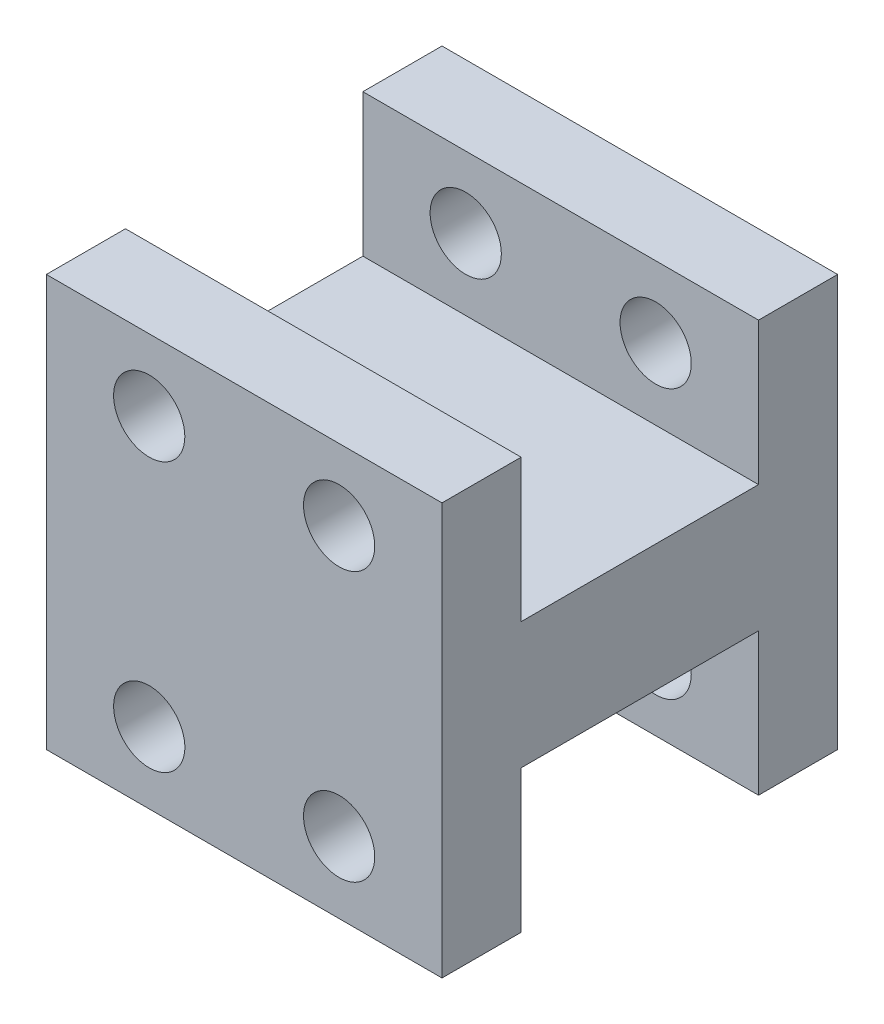
ISO-10303-21;
HEADER;
FILE_DESCRIPTION(('STEP AP214'),'2;1');
FILE_NAME('part.step','',(''),(''),'','','');
FILE_SCHEMA(('AUTOMOTIVE_DESIGN { 1 0 10303 214 1 1 1 1 }'));
ENDSEC;
DATA;
#1=APPLICATION_CONTEXT('core data for automotive mechanical design processes');
#2=APPLICATION_PROTOCOL_DEFINITION('international standard','automotive_design',2000,#1);
#3=PRODUCT_CONTEXT('',#1,'mechanical');
#4=PRODUCT('Part','Part','',(#3));
#5=PRODUCT_RELATED_PRODUCT_CATEGORY('part','',(#4));
#6=PRODUCT_DEFINITION_FORMATION('','',#4);
#7=PRODUCT_DEFINITION_CONTEXT('part definition',#1,'design');
#8=PRODUCT_DEFINITION('design','',#6,#7);
#9=PRODUCT_DEFINITION_SHAPE('','',#8);
#10=(LENGTH_UNIT() NAMED_UNIT(*) SI_UNIT(.MILLI.,.METRE.));
#11=(NAMED_UNIT(*) PLANE_ANGLE_UNIT() SI_UNIT($,.RADIAN.));
#12=(NAMED_UNIT(*) SI_UNIT($,.STERADIAN.) SOLID_ANGLE_UNIT());
#13=UNCERTAINTY_MEASURE_WITH_UNIT(LENGTH_MEASURE(1.E-05),#10,'distance_accuracy_value','');
#14=(GEOMETRIC_REPRESENTATION_CONTEXT(3) GLOBAL_UNCERTAINTY_ASSIGNED_CONTEXT((#13)) GLOBAL_UNIT_ASSIGNED_CONTEXT((#10,
#11,#12)) REPRESENTATION_CONTEXT('',''));
#15=CARTESIAN_POINT('',(0.,0.,0.));
#16=DIRECTION('',(0.,0.,1.));
#17=DIRECTION('',(1.,0.,0.));
#18=AXIS2_PLACEMENT_3D('',#15,#16,#17);
#19=CARTESIAN_POINT('',(0.,0.,5.));
#20=DIRECTION('',(1.,0.,0.));
#21=DIRECTION('',(0.,1.,0.));
#22=AXIS2_PLACEMENT_3D('',#19,#20,#21);
#23=PLANE('',#22);
#24=DIRECTION('',(0.,0.,-1.));
#25=VECTOR('',#24,1.);
#26=CARTESIAN_POINT('',(0.,29.,20.));
#27=LINE('',#26,#25);
#28=CARTESIAN_POINT('',(0.,29.,20.));
#29=VERTEX_POINT('',#28);
#30=CARTESIAN_POINT('',(0.,29.,5.));
#31=VERTEX_POINT('',#30);
#32=EDGE_CURVE('E42',#29,#31,#27,.T.);
#33=ORIENTED_EDGE('',*,*,#32,.T.);
#34=DIRECTION('',(0.,-1.,0.));
#35=VECTOR('',#34,1.);
#36=CARTESIAN_POINT('',(0.,12.,5.));
#37=LINE('',#36,#35);
#38=CARTESIAN_POINT('',(0.,38.,5.));
#39=VERTEX_POINT('',#38);
#40=EDGE_CURVE('E163',#39,#31,#37,.T.);
#41=ORIENTED_EDGE('',*,*,#40,.F.);
#42=DIRECTION('',(0.,0.,1.));
#43=VECTOR('',#42,1.);
#44=CARTESIAN_POINT('',(0.,38.,0.));
#45=LINE('',#44,#43);
#46=CARTESIAN_POINT('',(0.,38.,0.));
#47=VERTEX_POINT('',#46);
#48=EDGE_CURVE('E168',#47,#39,#45,.T.);
#49=ORIENTED_EDGE('',*,*,#48,.F.);
#50=DIRECTION('',(0.,-1.,0.));
#51=VECTOR('',#50,1.);
#52=CARTESIAN_POINT('',(0.,12.,0.));
#53=LINE('',#52,#51);
#54=CARTESIAN_POINT('',(0.,12.,0.));
#55=VERTEX_POINT('',#54);
#56=EDGE_CURVE('E151',#47,#55,#53,.T.);
#57=ORIENTED_EDGE('',*,*,#56,.T.);
#58=DIRECTION('',(0.,0.,1.));
#59=VECTOR('',#58,1.);
#60=CARTESIAN_POINT('',(0.,12.,0.));
#61=LINE('',#60,#59);
#62=CARTESIAN_POINT('',(0.,12.,5.));
#63=VERTEX_POINT('',#62);
#64=EDGE_CURVE('E137',#55,#63,#61,.T.);
#65=ORIENTED_EDGE('',*,*,#64,.T.);
#66=CARTESIAN_POINT('',(0.,21.,5.));
#67=VERTEX_POINT('',#66);
#68=EDGE_CURVE('E162',#67,#63,#37,.T.);
#69=ORIENTED_EDGE('',*,*,#68,.F.);
#70=DIRECTION('',(0.,0.,-1.));
#71=VECTOR('',#70,1.);
#72=CARTESIAN_POINT('',(0.,21.,20.));
#73=LINE('',#72,#71);
#74=CARTESIAN_POINT('',(0.,21.,20.));
#75=VERTEX_POINT('',#74);
#76=EDGE_CURVE('E49',#75,#67,#73,.T.);
#77=ORIENTED_EDGE('',*,*,#76,.F.);
#78=DIRECTION('',(0.,-1.,0.));
#79=VECTOR('',#78,1.);
#80=CARTESIAN_POINT('',(0.,12.,20.));
#81=LINE('',#80,#79);
#82=CARTESIAN_POINT('',(0.,12.,20.));
#83=VERTEX_POINT('',#82);
#84=EDGE_CURVE('E211',#75,#83,#81,.T.);
#85=ORIENTED_EDGE('',*,*,#84,.T.);
#86=DIRECTION('',(0.,0.,-1.));
#87=VECTOR('',#86,1.);
#88=CARTESIAN_POINT('',(0.,12.,25.));
#89=LINE('',#88,#87);
#90=CARTESIAN_POINT('',(0.,12.,25.));
#91=VERTEX_POINT('',#90);
#92=EDGE_CURVE('E218',#91,#83,#89,.T.);
#93=ORIENTED_EDGE('',*,*,#92,.F.);
#94=DIRECTION('',(0.,-1.,0.));
#95=VECTOR('',#94,1.);
#96=CARTESIAN_POINT('',(0.,12.,25.));
#97=LINE('',#96,#95);
#98=CARTESIAN_POINT('',(0.,38.,25.));
#99=VERTEX_POINT('',#98);
#100=EDGE_CURVE('E201',#99,#91,#97,.T.);
#101=ORIENTED_EDGE('',*,*,#100,.F.);
#102=DIRECTION('',(0.,0.,-1.));
#103=VECTOR('',#102,1.);
#104=CARTESIAN_POINT('',(0.,38.,25.));
#105=LINE('',#104,#103);
#106=CARTESIAN_POINT('',(0.,38.,20.));
#107=VERTEX_POINT('',#106);
#108=EDGE_CURVE('E221',#99,#107,#105,.T.);
#109=ORIENTED_EDGE('',*,*,#108,.T.);
#110=EDGE_CURVE('E212',#107,#29,#81,.T.);
#111=ORIENTED_EDGE('',*,*,#110,.T.);
#112=EDGE_LOOP('',(#33,#41,#49,#57,#65,#69,#77,#85,#93,#101,#109,#111));
#113=FACE_BOUND('',#112,.T.);
#114=ADVANCED_FACE('F35',(#113),#23,.F.);
#115=CARTESIAN_POINT('',(25.,0.,5.));
#116=DIRECTION('',(-1.,0.,0.));
#117=DIRECTION('',(0.,-1.,0.));
#118=AXIS2_PLACEMENT_3D('',#115,#116,#117);
#119=PLANE('',#118);
#120=DIRECTION('',(0.,0.,-1.));
#121=VECTOR('',#120,1.);
#122=CARTESIAN_POINT('',(25.,21.,20.));
#123=LINE('',#122,#121);
#124=CARTESIAN_POINT('',(25.,21.,20.));
#125=VERTEX_POINT('',#124);
#126=CARTESIAN_POINT('',(25.,21.,5.));
#127=VERTEX_POINT('',#126);
#128=EDGE_CURVE('E234',#125,#127,#123,.T.);
#129=ORIENTED_EDGE('',*,*,#128,.T.);
#130=DIRECTION('',(0.,1.,0.));
#131=VECTOR('',#130,1.);
#132=CARTESIAN_POINT('',(25.,12.,5.));
#133=LINE('',#132,#131);
#134=CARTESIAN_POINT('',(25.,12.,5.));
#135=VERTEX_POINT('',#134);
#136=EDGE_CURVE('E131',#135,#127,#133,.T.);
#137=ORIENTED_EDGE('',*,*,#136,.F.);
#138=DIRECTION('',(0.,0.,1.));
#139=VECTOR('',#138,1.);
#140=CARTESIAN_POINT('',(25.,12.,0.));
#141=LINE('',#140,#139);
#142=CARTESIAN_POINT('',(25.,12.,0.));
#143=VERTEX_POINT('',#142);
#144=EDGE_CURVE('E124',#143,#135,#141,.T.);
#145=ORIENTED_EDGE('',*,*,#144,.F.);
#146=DIRECTION('',(0.,1.,0.));
#147=VECTOR('',#146,1.);
#148=CARTESIAN_POINT('',(25.,12.,0.));
#149=LINE('',#148,#147);
#150=CARTESIAN_POINT('',(25.,38.,0.));
#151=VERTEX_POINT('',#150);
#152=EDGE_CURVE('E129',#143,#151,#149,.T.);
#153=ORIENTED_EDGE('',*,*,#152,.T.);
#154=DIRECTION('',(0.,0.,1.));
#155=VECTOR('',#154,1.);
#156=CARTESIAN_POINT('',(25.,38.,0.));
#157=LINE('',#156,#155);
#158=CARTESIAN_POINT('',(25.,38.,5.));
#159=VERTEX_POINT('',#158);
#160=EDGE_CURVE('E157',#151,#159,#157,.T.);
#161=ORIENTED_EDGE('',*,*,#160,.T.);
#162=CARTESIAN_POINT('',(25.,29.,5.));
#163=VERTEX_POINT('',#162);
#164=EDGE_CURVE('E160',#163,#159,#133,.T.);
#165=ORIENTED_EDGE('',*,*,#164,.F.);
#166=DIRECTION('',(0.,0.,-1.));
#167=VECTOR('',#166,1.);
#168=CARTESIAN_POINT('',(25.,29.,20.));
#169=LINE('',#168,#167);
#170=CARTESIAN_POINT('',(25.,29.,20.));
#171=VERTEX_POINT('',#170);
#172=EDGE_CURVE('E11',#171,#163,#169,.T.);
#173=ORIENTED_EDGE('',*,*,#172,.F.);
#174=DIRECTION('',(0.,1.,0.));
#175=VECTOR('',#174,1.);
#176=CARTESIAN_POINT('',(25.,12.,20.));
#177=LINE('',#176,#175);
#178=CARTESIAN_POINT('',(25.,38.,20.));
#179=VERTEX_POINT('',#178);
#180=EDGE_CURVE('E192',#171,#179,#177,.T.);
#181=ORIENTED_EDGE('',*,*,#180,.T.);
#182=DIRECTION('',(0.,0.,-1.));
#183=VECTOR('',#182,1.);
#184=CARTESIAN_POINT('',(25.,38.,25.));
#185=LINE('',#184,#183);
#186=CARTESIAN_POINT('',(25.,38.,25.));
#187=VERTEX_POINT('',#186);
#188=EDGE_CURVE('E224',#187,#179,#185,.T.);
#189=ORIENTED_EDGE('',*,*,#188,.F.);
#190=DIRECTION('',(0.,1.,0.));
#191=VECTOR('',#190,1.);
#192=CARTESIAN_POINT('',(25.,12.,25.));
#193=LINE('',#192,#191);
#194=CARTESIAN_POINT('',(25.,12.,25.));
#195=VERTEX_POINT('',#194);
#196=EDGE_CURVE('E195',#195,#187,#193,.T.);
#197=ORIENTED_EDGE('',*,*,#196,.F.);
#198=DIRECTION('',(0.,0.,-1.));
#199=VECTOR('',#198,1.);
#200=CARTESIAN_POINT('',(25.,12.,25.));
#201=LINE('',#200,#199);
#202=CARTESIAN_POINT('',(25.,12.,20.));
#203=VERTEX_POINT('',#202);
#204=EDGE_CURVE('E205',#195,#203,#201,.T.);
#205=ORIENTED_EDGE('',*,*,#204,.T.);
#206=EDGE_CURVE('E206',#203,#125,#177,.T.);
#207=ORIENTED_EDGE('',*,*,#206,.T.);
#208=EDGE_LOOP('',(#129,#137,#145,#153,#161,#165,#173,#181,#189,#197,#205,#207));
#209=FACE_BOUND('',#208,.T.);
#210=ADVANCED_FACE('F127',(#209),#119,.F.);
#211=CARTESIAN_POINT('',(25.,29.,20.));
#212=DIRECTION('',(0.,-1.,0.));
#213=DIRECTION('',(1.,0.,0.));
#214=AXIS2_PLACEMENT_3D('',#211,#212,#213);
#215=PLANE('',#214);
#216=DIRECTION('',(-1.,0.,0.));
#217=VECTOR('',#216,1.);
#218=CARTESIAN_POINT('',(25.,29.,5.));
#219=LINE('',#218,#217);
#220=EDGE_CURVE('E227',#163,#31,#219,.T.);
#221=ORIENTED_EDGE('',*,*,#220,.T.);
#222=ORIENTED_EDGE('',*,*,#32,.F.);
#223=DIRECTION('',(-1.,0.,0.));
#224=VECTOR('',#223,1.);
#225=CARTESIAN_POINT('',(25.,29.,20.));
#226=LINE('',#225,#224);
#227=EDGE_CURVE('E228',#171,#29,#226,.T.);
#228=ORIENTED_EDGE('',*,*,#227,.F.);
#229=ORIENTED_EDGE('',*,*,#172,.T.);
#230=EDGE_LOOP('',(#221,#222,#228,#229));
#231=FACE_BOUND('',#230,.T.);
#232=ADVANCED_FACE('F248',(#231),#215,.F.);
#233=CARTESIAN_POINT('',(25.,21.,20.));
#234=DIRECTION('',(0.,1.,0.));
#235=DIRECTION('',(-1.,0.,0.));
#236=AXIS2_PLACEMENT_3D('',#233,#234,#235);
#237=PLANE('',#236);
#238=DIRECTION('',(1.,0.,0.));
#239=VECTOR('',#238,1.);
#240=CARTESIAN_POINT('',(25.,21.,5.));
#241=LINE('',#240,#239);
#242=EDGE_CURVE('E231',#67,#127,#241,.T.);
#243=ORIENTED_EDGE('',*,*,#242,.T.);
#244=ORIENTED_EDGE('',*,*,#128,.F.);
#245=DIRECTION('',(1.,0.,0.));
#246=VECTOR('',#245,1.);
#247=CARTESIAN_POINT('',(25.,21.,20.));
#248=LINE('',#247,#246);
#249=EDGE_CURVE('E230',#75,#125,#248,.T.);
#250=ORIENTED_EDGE('',*,*,#249,.F.);
#251=ORIENTED_EDGE('',*,*,#76,.T.);
#252=EDGE_LOOP('',(#243,#244,#250,#251));
#253=FACE_BOUND('',#252,.T.);
#254=ADVANCED_FACE('F307',(#253),#237,.F.);
#255=CARTESIAN_POINT('',(0.,0.,20.));
#256=DIRECTION('',(0.,0.,1.));
#257=DIRECTION('',(1.,0.,0.));
#258=AXIS2_PLACEMENT_3D('',#255,#256,#257);
#259=PLANE('',#258);
#260=CARTESIAN_POINT('',(6.5,33.5,20.));
#261=DIRECTION('',(0.,0.,-1.));
#262=DIRECTION('',(1.,0.,0.));
#263=AXIS2_PLACEMENT_3D('',#260,#261,#262);
#264=CIRCLE('',#263,2.25);
#265=CARTESIAN_POINT('',(8.75,33.5,20.));
#266=VERTEX_POINT('',#265);
#267=EDGE_CURVE('E175',#266,#266,#264,.T.);
#268=ORIENTED_EDGE('',*,*,#267,.F.);
#269=EDGE_LOOP('',(#268));
#270=FACE_BOUND('',#269,.T.);
#271=CARTESIAN_POINT('',(18.5,33.5,20.));
#272=DIRECTION('',(0.,0.,-1.));
#273=DIRECTION('',(-1.,0.,0.));
#274=AXIS2_PLACEMENT_3D('',#271,#272,#273);
#275=CIRCLE('',#274,2.25);
#276=CARTESIAN_POINT('',(16.25,33.5,20.));
#277=VERTEX_POINT('',#276);
#278=EDGE_CURVE('E174',#277,#277,#275,.T.);
#279=ORIENTED_EDGE('',*,*,#278,.F.);
#280=EDGE_LOOP('',(#279));
#281=FACE_BOUND('',#280,.T.);
#282=ORIENTED_EDGE('',*,*,#180,.F.);
#283=ORIENTED_EDGE('',*,*,#227,.T.);
#284=ORIENTED_EDGE('',*,*,#110,.F.);
#285=DIRECTION('',(-1.,0.,0.));
#286=VECTOR('',#285,1.);
#287=CARTESIAN_POINT('',(25.,38.,20.));
#288=LINE('',#287,#286);
#289=EDGE_CURVE('E209',#179,#107,#288,.T.);
#290=ORIENTED_EDGE('',*,*,#289,.F.);
#291=EDGE_LOOP('',(#282,#283,#284,#290));
#292=FACE_BOUND('',#291,.T.);
#293=ADVANCED_FACE('F246',(#270,#281,#292),#259,.F.);
#294=CARTESIAN_POINT('',(6.5,16.5,20.));
#295=DIRECTION('',(0.,0.,-1.));
#296=DIRECTION('',(-1.,0.,0.));
#297=AXIS2_PLACEMENT_3D('',#294,#295,#296);
#298=CIRCLE('',#297,2.25);
#299=CARTESIAN_POINT('',(4.25,16.5,20.));
#300=VERTEX_POINT('',#299);
#301=EDGE_CURVE('E181',#300,#300,#298,.T.);
#302=ORIENTED_EDGE('',*,*,#301,.F.);
#303=EDGE_LOOP('',(#302));
#304=FACE_BOUND('',#303,.T.);
#305=CARTESIAN_POINT('',(18.5,16.5,20.));
#306=DIRECTION('',(0.,0.,-1.));
#307=DIRECTION('',(1.,0.,0.));
#308=AXIS2_PLACEMENT_3D('',#305,#306,#307);
#309=CIRCLE('',#308,2.25);
#310=CARTESIAN_POINT('',(20.75,16.5,20.));
#311=VERTEX_POINT('',#310);
#312=EDGE_CURVE('E136',#311,#311,#309,.T.);
#313=ORIENTED_EDGE('',*,*,#312,.F.);
#314=EDGE_LOOP('',(#313));
#315=FACE_BOUND('',#314,.T.);
#316=ORIENTED_EDGE('',*,*,#84,.F.);
#317=ORIENTED_EDGE('',*,*,#249,.T.);
#318=ORIENTED_EDGE('',*,*,#206,.F.);
#319=DIRECTION('',(1.,0.,0.));
#320=VECTOR('',#319,1.);
#321=CARTESIAN_POINT('',(25.,12.,20.));
#322=LINE('',#321,#320);
#323=EDGE_CURVE('E199',#83,#203,#322,.T.);
#324=ORIENTED_EDGE('',*,*,#323,.F.);
#325=EDGE_LOOP('',(#316,#317,#318,#324));
#326=FACE_BOUND('',#325,.T.);
#327=ADVANCED_FACE('F312',(#304,#315,#326),#259,.F.);
#328=CARTESIAN_POINT('',(25.,38.,25.));
#329=DIRECTION('',(0.,-1.,0.));
#330=DIRECTION('',(1.,0.,0.));
#331=AXIS2_PLACEMENT_3D('',#328,#329,#330);
#332=PLANE('',#331);
#333=ORIENTED_EDGE('',*,*,#289,.T.);
#334=ORIENTED_EDGE('',*,*,#108,.F.);
#335=DIRECTION('',(-1.,0.,0.));
#336=VECTOR('',#335,1.);
#337=CARTESIAN_POINT('',(25.,38.,25.));
#338=LINE('',#337,#336);
#339=EDGE_CURVE('E198',#187,#99,#338,.T.);
#340=ORIENTED_EDGE('',*,*,#339,.F.);
#341=ORIENTED_EDGE('',*,*,#188,.T.);
#342=EDGE_LOOP('',(#333,#334,#340,#341));
#343=FACE_BOUND('',#342,.T.);
#344=ADVANCED_FACE('F322',(#343),#332,.F.);
#345=CARTESIAN_POINT('',(25.,12.,25.));
#346=DIRECTION('',(0.,1.,0.));
#347=DIRECTION('',(-1.,0.,0.));
#348=AXIS2_PLACEMENT_3D('',#345,#346,#347);
#349=PLANE('',#348);
#350=ORIENTED_EDGE('',*,*,#323,.T.);
#351=ORIENTED_EDGE('',*,*,#204,.F.);
#352=DIRECTION('',(1.,0.,0.));
#353=VECTOR('',#352,1.);
#354=CARTESIAN_POINT('',(25.,12.,25.));
#355=LINE('',#354,#353);
#356=EDGE_CURVE('E203',#91,#195,#355,.T.);
#357=ORIENTED_EDGE('',*,*,#356,.F.);
#358=ORIENTED_EDGE('',*,*,#92,.T.);
#359=EDGE_LOOP('',(#350,#351,#357,#358));
#360=FACE_BOUND('',#359,.T.);
#361=ADVANCED_FACE('F316',(#360),#349,.F.);
#362=CARTESIAN_POINT('',(0.,0.,25.));
#363=DIRECTION('',(0.,0.,1.));
#364=DIRECTION('',(1.,0.,0.));
#365=AXIS2_PLACEMENT_3D('',#362,#363,#364);
#366=PLANE('',#365);
#367=CARTESIAN_POINT('',(6.5,33.5,25.));
#368=DIRECTION('',(0.,0.,-1.));
#369=DIRECTION('',(1.,0.,0.));
#370=AXIS2_PLACEMENT_3D('',#367,#368,#369);
#371=CIRCLE('',#370,2.25);
#372=CARTESIAN_POINT('',(8.75,33.5,25.));
#373=VERTEX_POINT('',#372);
#374=EDGE_CURVE('E171',#373,#373,#371,.T.);
#375=ORIENTED_EDGE('',*,*,#374,.T.);
#376=EDGE_LOOP('',(#375));
#377=FACE_BOUND('',#376,.T.);
#378=CARTESIAN_POINT('',(6.5,16.5,25.));
#379=DIRECTION('',(0.,0.,-1.));
#380=DIRECTION('',(-1.,0.,0.));
#381=AXIS2_PLACEMENT_3D('',#378,#379,#380);
#382=CIRCLE('',#381,2.25);
#383=CARTESIAN_POINT('',(4.25,16.5,25.));
#384=VERTEX_POINT('',#383);
#385=EDGE_CURVE('E178',#384,#384,#382,.T.);
#386=ORIENTED_EDGE('',*,*,#385,.T.);
#387=EDGE_LOOP('',(#386));
#388=FACE_BOUND('',#387,.T.);
#389=CARTESIAN_POINT('',(18.5,16.5,25.));
#390=DIRECTION('',(0.,0.,-1.));
#391=DIRECTION('',(1.,0.,0.));
#392=AXIS2_PLACEMENT_3D('',#389,#390,#391);
#393=CIRCLE('',#392,2.25);
#394=CARTESIAN_POINT('',(20.75,16.5,25.));
#395=VERTEX_POINT('',#394);
#396=EDGE_CURVE('E184',#395,#395,#393,.T.);
#397=ORIENTED_EDGE('',*,*,#396,.T.);
#398=EDGE_LOOP('',(#397));
#399=FACE_BOUND('',#398,.T.);
#400=CARTESIAN_POINT('',(18.5,33.5,25.));
#401=DIRECTION('',(0.,0.,-1.));
#402=DIRECTION('',(-1.,0.,0.));
#403=AXIS2_PLACEMENT_3D('',#400,#401,#402);
#404=CIRCLE('',#403,2.25);
#405=CARTESIAN_POINT('',(16.25,33.5,25.));
#406=VERTEX_POINT('',#405);
#407=EDGE_CURVE('E189',#406,#406,#404,.T.);
#408=ORIENTED_EDGE('',*,*,#407,.T.);
#409=EDGE_LOOP('',(#408));
#410=FACE_BOUND('',#409,.T.);
#411=ORIENTED_EDGE('',*,*,#196,.T.);
#412=ORIENTED_EDGE('',*,*,#339,.T.);
#413=ORIENTED_EDGE('',*,*,#100,.T.);
#414=ORIENTED_EDGE('',*,*,#356,.T.);
#415=EDGE_LOOP('',(#411,#412,#413,#414));
#416=FACE_BOUND('',#415,.T.);
#417=ADVANCED_FACE('F320',(#377,#388,#399,#410,#416),#366,.T.);
#418=CARTESIAN_POINT('',(18.5,33.5,25.));
#419=DIRECTION('',(0.,0.,-1.));
#420=DIRECTION('',(-1.,0.,0.));
#421=AXIS2_PLACEMENT_3D('',#418,#419,#420);
#422=CYLINDRICAL_SURFACE('',#421,2.25);
#423=ORIENTED_EDGE('',*,*,#407,.F.);
#424=EDGE_LOOP('',(#423));
#425=FACE_BOUND('',#424,.T.);
#426=ORIENTED_EDGE('',*,*,#278,.T.);
#427=EDGE_LOOP('',(#426));
#428=FACE_BOUND('',#427,.T.);
#429=ADVANCED_FACE('F353',(#425,#428),#422,.F.);
#430=CARTESIAN_POINT('',(18.5,16.5,25.));
#431=DIRECTION('',(0.,0.,-1.));
#432=DIRECTION('',(-1.,0.,0.));
#433=AXIS2_PLACEMENT_3D('',#430,#431,#432);
#434=CYLINDRICAL_SURFACE('',#433,2.25);
#435=ORIENTED_EDGE('',*,*,#396,.F.);
#436=EDGE_LOOP('',(#435));
#437=FACE_BOUND('',#436,.T.);
#438=ORIENTED_EDGE('',*,*,#312,.T.);
#439=EDGE_LOOP('',(#438));
#440=FACE_BOUND('',#439,.T.);
#441=ADVANCED_FACE('F357',(#437,#440),#434,.F.);
#442=CARTESIAN_POINT('',(6.5,16.5,25.));
#443=DIRECTION('',(0.,0.,-1.));
#444=DIRECTION('',(-1.,0.,0.));
#445=AXIS2_PLACEMENT_3D('',#442,#443,#444);
#446=CYLINDRICAL_SURFACE('',#445,2.25);
#447=ORIENTED_EDGE('',*,*,#385,.F.);
#448=EDGE_LOOP('',(#447));
#449=FACE_BOUND('',#448,.T.);
#450=ORIENTED_EDGE('',*,*,#301,.T.);
#451=EDGE_LOOP('',(#450));
#452=FACE_BOUND('',#451,.T.);
#453=ADVANCED_FACE('F361',(#449,#452),#446,.F.);
#454=CARTESIAN_POINT('',(6.5,33.5,25.));
#455=DIRECTION('',(0.,0.,-1.));
#456=DIRECTION('',(-1.,0.,0.));
#457=AXIS2_PLACEMENT_3D('',#454,#455,#456);
#458=CYLINDRICAL_SURFACE('',#457,2.25);
#459=ORIENTED_EDGE('',*,*,#374,.F.);
#460=EDGE_LOOP('',(#459));
#461=FACE_BOUND('',#460,.T.);
#462=ORIENTED_EDGE('',*,*,#267,.T.);
#463=EDGE_LOOP('',(#462));
#464=FACE_BOUND('',#463,.T.);
#465=ADVANCED_FACE('F303',(#461,#464),#458,.F.);
#466=CARTESIAN_POINT('',(0.,0.,5.));
#467=DIRECTION('',(0.,0.,-1.));
#468=DIRECTION('',(1.,0.,0.));
#469=AXIS2_PLACEMENT_3D('',#466,#467,#468);
#470=PLANE('',#469);
#471=CARTESIAN_POINT('',(6.5,16.5,5.));
#472=DIRECTION('',(0.,0.,-1.));
#473=DIRECTION('',(-1.,0.,0.));
#474=AXIS2_PLACEMENT_3D('',#471,#472,#473);
#475=CIRCLE('',#474,2.25);
#476=CARTESIAN_POINT('',(4.25,16.5,5.));
#477=VERTEX_POINT('',#476);
#478=EDGE_CURVE('E268',#477,#477,#475,.T.);
#479=ORIENTED_EDGE('',*,*,#478,.T.);
#480=EDGE_LOOP('',(#479));
#481=FACE_BOUND('',#480,.T.);
#482=CARTESIAN_POINT('',(18.5,16.5,5.));
#483=DIRECTION('',(0.,0.,-1.));
#484=DIRECTION('',(1.,0.,0.));
#485=AXIS2_PLACEMENT_3D('',#482,#483,#484);
#486=CIRCLE('',#485,2.25);
#487=CARTESIAN_POINT('',(20.75,16.5,5.));
#488=VERTEX_POINT('',#487);
#489=EDGE_CURVE('E262',#488,#488,#486,.T.);
#490=ORIENTED_EDGE('',*,*,#489,.T.);
#491=EDGE_LOOP('',(#490));
#492=FACE_BOUND('',#491,.T.);
#493=ORIENTED_EDGE('',*,*,#242,.F.);
#494=ORIENTED_EDGE('',*,*,#68,.T.);
#495=DIRECTION('',(1.,0.,0.));
#496=VECTOR('',#495,1.);
#497=CARTESIAN_POINT('',(25.,12.,5.));
#498=LINE('',#497,#496);
#499=EDGE_CURVE('E159',#63,#135,#498,.T.);
#500=ORIENTED_EDGE('',*,*,#499,.T.);
#501=ORIENTED_EDGE('',*,*,#136,.T.);
#502=EDGE_LOOP('',(#493,#494,#500,#501));
#503=FACE_BOUND('',#502,.T.);
#504=ADVANCED_FACE('F300',(#481,#492,#503),#470,.F.);
#505=CARTESIAN_POINT('',(25.,12.,0.));
#506=DIRECTION('',(0.,-1.,0.));
#507=DIRECTION('',(1.,0.,0.));
#508=AXIS2_PLACEMENT_3D('',#505,#506,#507);
#509=PLANE('',#508);
#510=ORIENTED_EDGE('',*,*,#499,.F.);
#511=ORIENTED_EDGE('',*,*,#64,.F.);
#512=DIRECTION('',(1.,0.,0.));
#513=VECTOR('',#512,1.);
#514=CARTESIAN_POINT('',(25.,12.,0.));
#515=LINE('',#514,#513);
#516=EDGE_CURVE('E143',#55,#143,#515,.T.);
#517=ORIENTED_EDGE('',*,*,#516,.T.);
#518=ORIENTED_EDGE('',*,*,#144,.T.);
#519=EDGE_LOOP('',(#510,#511,#517,#518));
#520=FACE_BOUND('',#519,.T.);
#521=ADVANCED_FACE('F149',(#520),#509,.T.);
#522=CARTESIAN_POINT('',(25.,38.,0.));
#523=DIRECTION('',(0.,1.,0.));
#524=DIRECTION('',(-1.,0.,0.));
#525=AXIS2_PLACEMENT_3D('',#522,#523,#524);
#526=PLANE('',#525);
#527=DIRECTION('',(-1.,0.,0.));
#528=VECTOR('',#527,1.);
#529=CARTESIAN_POINT('',(25.,38.,5.));
#530=LINE('',#529,#528);
#531=EDGE_CURVE('E147',#159,#39,#530,.T.);
#532=ORIENTED_EDGE('',*,*,#531,.F.);
#533=ORIENTED_EDGE('',*,*,#160,.F.);
#534=DIRECTION('',(-1.,0.,0.));
#535=VECTOR('',#534,1.);
#536=CARTESIAN_POINT('',(25.,38.,0.));
#537=LINE('',#536,#535);
#538=EDGE_CURVE('E146',#151,#47,#537,.T.);
#539=ORIENTED_EDGE('',*,*,#538,.T.);
#540=ORIENTED_EDGE('',*,*,#48,.T.);
#541=EDGE_LOOP('',(#532,#533,#539,#540));
#542=FACE_BOUND('',#541,.T.);
#543=ADVANCED_FACE('F286',(#542),#526,.T.);
#544=CARTESIAN_POINT('',(0.,0.,0.));
#545=DIRECTION('',(0.,0.,-1.));
#546=DIRECTION('',(1.,0.,0.));
#547=AXIS2_PLACEMENT_3D('',#544,#545,#546);
#548=PLANE('',#547);
#549=CARTESIAN_POINT('',(6.5,33.5,0.));
#550=DIRECTION('',(0.,0.,-1.));
#551=DIRECTION('',(1.,0.,0.));
#552=AXIS2_PLACEMENT_3D('',#549,#550,#551);
#553=CIRCLE('',#552,2.25);
#554=CARTESIAN_POINT('',(8.75,33.5,0.));
#555=VERTEX_POINT('',#554);
#556=EDGE_CURVE('E260',#555,#555,#553,.T.);
#557=ORIENTED_EDGE('',*,*,#556,.F.);
#558=EDGE_LOOP('',(#557));
#559=FACE_BOUND('',#558,.T.);
#560=CARTESIAN_POINT('',(6.5,16.5,0.));
#561=DIRECTION('',(0.,0.,-1.));
#562=DIRECTION('',(-1.,0.,0.));
#563=AXIS2_PLACEMENT_3D('',#560,#561,#562);
#564=CIRCLE('',#563,2.25);
#565=CARTESIAN_POINT('',(4.25,16.5,0.));
#566=VERTEX_POINT('',#565);
#567=EDGE_CURVE('E271',#566,#566,#564,.T.);
#568=ORIENTED_EDGE('',*,*,#567,.F.);
#569=EDGE_LOOP('',(#568));
#570=FACE_BOUND('',#569,.T.);
#571=CARTESIAN_POINT('',(18.5,16.5,0.));
#572=DIRECTION('',(0.,0.,-1.));
#573=DIRECTION('',(1.,0.,0.));
#574=AXIS2_PLACEMENT_3D('',#571,#572,#573);
#575=CIRCLE('',#574,2.25);
#576=CARTESIAN_POINT('',(20.75,16.5,0.));
#577=VERTEX_POINT('',#576);
#578=EDGE_CURVE('E265',#577,#577,#575,.T.);
#579=ORIENTED_EDGE('',*,*,#578,.F.);
#580=EDGE_LOOP('',(#579));
#581=FACE_BOUND('',#580,.T.);
#582=CARTESIAN_POINT('',(18.5,33.5,0.));
#583=DIRECTION('',(0.,0.,-1.));
#584=DIRECTION('',(-1.,0.,0.));
#585=AXIS2_PLACEMENT_3D('',#582,#583,#584);
#586=CIRCLE('',#585,2.25);
#587=CARTESIAN_POINT('',(16.25,33.5,0.));
#588=VERTEX_POINT('',#587);
#589=EDGE_CURVE('E253',#588,#588,#586,.T.);
#590=ORIENTED_EDGE('',*,*,#589,.F.);
#591=EDGE_LOOP('',(#590));
#592=FACE_BOUND('',#591,.T.);
#593=ORIENTED_EDGE('',*,*,#152,.F.);
#594=ORIENTED_EDGE('',*,*,#516,.F.);
#595=ORIENTED_EDGE('',*,*,#56,.F.);
#596=ORIENTED_EDGE('',*,*,#538,.F.);
#597=EDGE_LOOP('',(#593,#594,#595,#596));
#598=FACE_BOUND('',#597,.T.);
#599=ADVANCED_FACE('F141',(#559,#570,#581,#592,#598),#548,.T.);
#600=CARTESIAN_POINT('',(6.5,33.5,5.));
#601=DIRECTION('',(0.,0.,-1.));
#602=DIRECTION('',(1.,0.,0.));
#603=AXIS2_PLACEMENT_3D('',#600,#601,#602);
#604=CIRCLE('',#603,2.25);
#605=CARTESIAN_POINT('',(8.75,33.5,5.));
#606=VERTEX_POINT('',#605);
#607=EDGE_CURVE('E274',#606,#606,#604,.T.);
#608=ORIENTED_EDGE('',*,*,#607,.T.);
#609=EDGE_LOOP('',(#608));
#610=FACE_BOUND('',#609,.T.);
#611=CARTESIAN_POINT('',(18.5,33.5,5.));
#612=DIRECTION('',(0.,0.,-1.));
#613=DIRECTION('',(-1.,0.,0.));
#614=AXIS2_PLACEMENT_3D('',#611,#612,#613);
#615=CIRCLE('',#614,2.25);
#616=CARTESIAN_POINT('',(16.25,33.5,5.));
#617=VERTEX_POINT('',#616);
#618=EDGE_CURVE('E255',#617,#617,#615,.T.);
#619=ORIENTED_EDGE('',*,*,#618,.T.);
#620=EDGE_LOOP('',(#619));
#621=FACE_BOUND('',#620,.T.);
#622=ORIENTED_EDGE('',*,*,#220,.F.);
#623=ORIENTED_EDGE('',*,*,#164,.T.);
#624=ORIENTED_EDGE('',*,*,#531,.T.);
#625=ORIENTED_EDGE('',*,*,#40,.T.);
#626=EDGE_LOOP('',(#622,#623,#624,#625));
#627=FACE_BOUND('',#626,.T.);
#628=ADVANCED_FACE('F285',(#610,#621,#627),#470,.F.);
#629=CARTESIAN_POINT('',(18.5,33.5,0.));
#630=DIRECTION('',(0.,0.,1.));
#631=DIRECTION('',(1.,0.,0.));
#632=AXIS2_PLACEMENT_3D('',#629,#630,#631);
#633=CYLINDRICAL_SURFACE('',#632,2.25);
#634=ORIENTED_EDGE('',*,*,#589,.T.);
#635=EDGE_LOOP('',(#634));
#636=FACE_BOUND('',#635,.T.);
#637=ORIENTED_EDGE('',*,*,#618,.F.);
#638=EDGE_LOOP('',(#637));
#639=FACE_BOUND('',#638,.T.);
#640=ADVANCED_FACE('F374',(#636,#639),#633,.F.);
#641=CARTESIAN_POINT('',(6.5,33.5,0.));
#642=DIRECTION('',(0.,0.,1.));
#643=DIRECTION('',(1.,0.,0.));
#644=AXIS2_PLACEMENT_3D('',#641,#642,#643);
#645=CYLINDRICAL_SURFACE('',#644,2.25);
#646=ORIENTED_EDGE('',*,*,#556,.T.);
#647=EDGE_LOOP('',(#646));
#648=FACE_BOUND('',#647,.T.);
#649=ORIENTED_EDGE('',*,*,#607,.F.);
#650=EDGE_LOOP('',(#649));
#651=FACE_BOUND('',#650,.T.);
#652=ADVANCED_FACE('F280',(#648,#651),#645,.F.);
#653=CARTESIAN_POINT('',(18.5,16.5,0.));
#654=DIRECTION('',(0.,0.,1.));
#655=DIRECTION('',(1.,0.,0.));
#656=AXIS2_PLACEMENT_3D('',#653,#654,#655);
#657=CYLINDRICAL_SURFACE('',#656,2.25);
#658=ORIENTED_EDGE('',*,*,#578,.T.);
#659=EDGE_LOOP('',(#658));
#660=FACE_BOUND('',#659,.T.);
#661=ORIENTED_EDGE('',*,*,#489,.F.);
#662=EDGE_LOOP('',(#661));
#663=FACE_BOUND('',#662,.T.);
#664=ADVANCED_FACE('F293',(#660,#663),#657,.F.);
#665=CARTESIAN_POINT('',(6.5,16.5,0.));
#666=DIRECTION('',(0.,0.,1.));
#667=DIRECTION('',(1.,0.,0.));
#668=AXIS2_PLACEMENT_3D('',#665,#666,#667);
#669=CYLINDRICAL_SURFACE('',#668,2.25);
#670=ORIENTED_EDGE('',*,*,#567,.T.);
#671=EDGE_LOOP('',(#670));
#672=FACE_BOUND('',#671,.T.);
#673=ORIENTED_EDGE('',*,*,#478,.F.);
#674=EDGE_LOOP('',(#673));
#675=FACE_BOUND('',#674,.T.);
#676=ADVANCED_FACE('F296',(#672,#675),#669,.F.);
#677=CLOSED_SHELL('',(#114,#210,#232,#254,#293,#327,#344,#361,#417,#429,#441,#453,#465,#504,
#521,#543,#599,#628,#640,#652,#664,#676));
#678=MANIFOLD_SOLID_BREP('B2',#677);
#679=ADVANCED_BREP_SHAPE_REPRESENTATION('',(#18,#678),#14);
#680=SHAPE_DEFINITION_REPRESENTATION(#9,#679);
ENDSEC;
END-ISO-10303-21;
